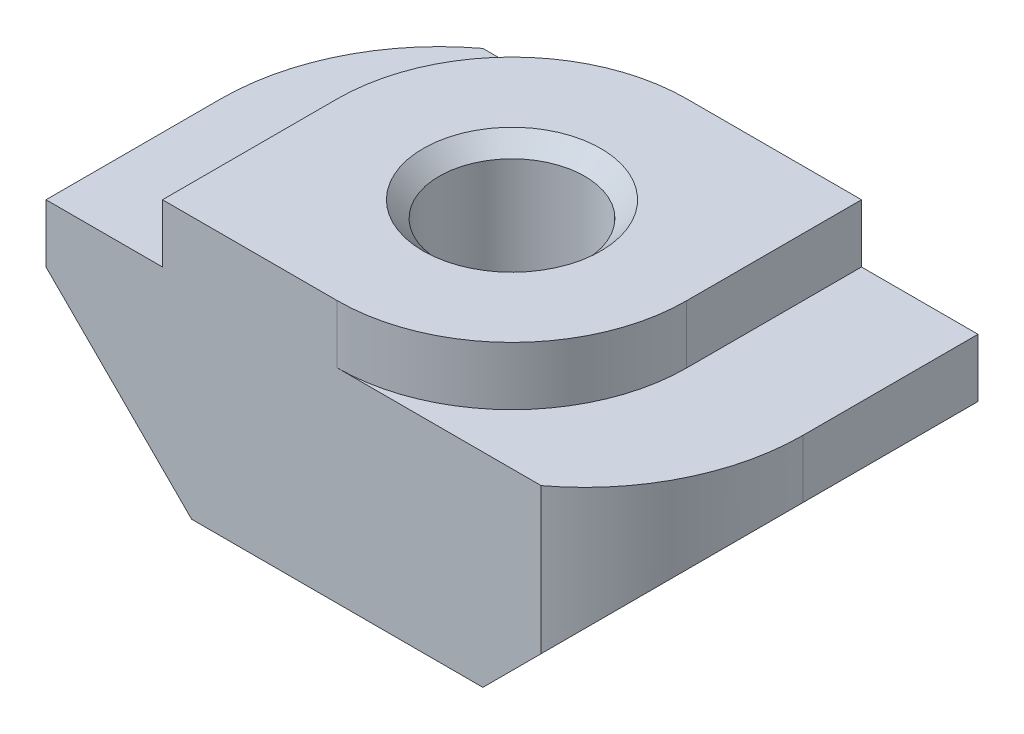
ISO-10303-21;
HEADER;
FILE_DESCRIPTION(('STEP AP214'),'2;1');
FILE_NAME('part.step','',(''),(''),'','','');
FILE_SCHEMA(('AUTOMOTIVE_DESIGN { 1 0 10303 214 1 1 1 1 }'));
ENDSEC;
DATA;
#1=APPLICATION_CONTEXT('core data for automotive mechanical design processes');
#2=APPLICATION_PROTOCOL_DEFINITION('international standard','automotive_design',2000,#1);
#3=PRODUCT_CONTEXT('',#1,'mechanical');
#4=PRODUCT('Part','Part','',(#3));
#5=PRODUCT_RELATED_PRODUCT_CATEGORY('part','',(#4));
#6=PRODUCT_DEFINITION_FORMATION('','',#4);
#7=PRODUCT_DEFINITION_CONTEXT('part definition',#1,'design');
#8=PRODUCT_DEFINITION('design','',#6,#7);
#9=PRODUCT_DEFINITION_SHAPE('','',#8);
#10=(LENGTH_UNIT() NAMED_UNIT(*) SI_UNIT(.MILLI.,.METRE.));
#11=(NAMED_UNIT(*) PLANE_ANGLE_UNIT() SI_UNIT($,.RADIAN.));
#12=(NAMED_UNIT(*) SI_UNIT($,.STERADIAN.) SOLID_ANGLE_UNIT());
#13=UNCERTAINTY_MEASURE_WITH_UNIT(LENGTH_MEASURE(1.E-05),#10,'distance_accuracy_value','');
#14=(GEOMETRIC_REPRESENTATION_CONTEXT(3) GLOBAL_UNCERTAINTY_ASSIGNED_CONTEXT((#13)) GLOBAL_UNIT_ASSIGNED_CONTEXT((#10,
#11,#12)) REPRESENTATION_CONTEXT('',''));
#15=CARTESIAN_POINT('',(0.,0.,0.));
#16=DIRECTION('',(0.,0.,1.));
#17=DIRECTION('',(1.,0.,0.));
#18=AXIS2_PLACEMENT_3D('',#15,#16,#17);
#19=CARTESIAN_POINT('',(0.,4.5,3.));
#20=DIRECTION('',(0.,1.,0.));
#21=DIRECTION('',(0.,0.,1.));
#22=AXIS2_PLACEMENT_3D('',#19,#20,#21);
#23=CYLINDRICAL_SURFACE('',#22,1.25);
#24=CARTESIAN_POINT('',(0.,0.,3.));
#25=DIRECTION('',(0.,1.,0.));
#26=DIRECTION('',(0.,0.,1.));
#27=AXIS2_PLACEMENT_3D('',#24,#25,#26);
#28=CIRCLE('',#27,1.25);
#29=CARTESIAN_POINT('',(0.,0.,4.25));
#30=VERTEX_POINT('',#29);
#31=EDGE_CURVE('E18',#30,#30,#28,.F.);
#32=ORIENTED_EDGE('',*,*,#31,.T.);
#33=EDGE_LOOP('',(#32));
#34=FACE_BOUND('',#33,.T.);
#35=CARTESIAN_POINT('',(0.,4.22500000001946,3.));
#36=DIRECTION('',(0.,1.,0.));
#37=DIRECTION('',(0.,0.,1.));
#38=AXIS2_PLACEMENT_3D('',#35,#36,#37);
#39=CIRCLE('',#38,1.25000000001319);
#40=CARTESIAN_POINT('',(0.,4.22500000001946,4.25000000001319));
#41=VERTEX_POINT('',#40);
#42=EDGE_CURVE('E164',#41,#41,#39,.T.);
#43=ORIENTED_EDGE('',*,*,#42,.T.);
#44=EDGE_LOOP('',(#43));
#45=FACE_BOUND('',#44,.T.);
#46=ADVANCED_FACE('F15',(#34,#45),#23,.F.);
#47=CARTESIAN_POINT('',(-5.,3.5,6.));
#48=DIRECTION('',(1.,0.,0.));
#49=DIRECTION('',(0.,0.,-1.));
#50=AXIS2_PLACEMENT_3D('',#47,#48,#49);
#51=PLANE('',#50);
#52=DIRECTION('',(0.,1.,0.));
#53=VECTOR('',#52,1.);
#54=CARTESIAN_POINT('',(-5.,0.,2.99999999999996));
#55=LINE('',#54,#53);
#56=CARTESIAN_POINT('',(-5.,2.5,2.99999999999998));
#57=VERTEX_POINT('',#56);
#58=CARTESIAN_POINT('',(-5.,3.5,2.99999999999998));
#59=VERTEX_POINT('',#58);
#60=EDGE_CURVE('E167',#57,#59,#55,.T.);
#61=ORIENTED_EDGE('',*,*,#60,.F.);
#62=DIRECTION('',(0.,0.,1.));
#63=VECTOR('',#62,1.);
#64=CARTESIAN_POINT('',(-4.99999999999999,2.49999999999999,6.));
#65=LINE('',#64,#63);
#66=CARTESIAN_POINT('',(-5.,2.5,6.));
#67=VERTEX_POINT('',#66);
#68=EDGE_CURVE('E194',#57,#67,#65,.T.);
#69=ORIENTED_EDGE('',*,*,#68,.T.);
#70=DIRECTION('',(0.,1.,0.));
#71=VECTOR('',#70,1.);
#72=CARTESIAN_POINT('',(-5.,3.5,6.));
#73=LINE('',#72,#71);
#74=CARTESIAN_POINT('',(-5.,3.5,6.));
#75=VERTEX_POINT('',#74);
#76=EDGE_CURVE('E122',#75,#67,#73,.F.);
#77=ORIENTED_EDGE('',*,*,#76,.F.);
#78=DIRECTION('',(0.,0.,-1.));
#79=VECTOR('',#78,1.);
#80=CARTESIAN_POINT('',(-5.,3.5,6.));
#81=LINE('',#80,#79);
#82=EDGE_CURVE('E190',#75,#59,#81,.T.);
#83=ORIENTED_EDGE('',*,*,#82,.T.);
#84=EDGE_LOOP('',(#61,#69,#77,#83));
#85=FACE_BOUND('',#84,.T.);
#86=ADVANCED_FACE('F291',(#85),#51,.F.);
#87=CARTESIAN_POINT('',(-1.25,0.,2.99999999999999));
#88=DIRECTION('',(0.,1.,0.));
#89=DIRECTION('',(0.,0.,1.));
#90=AXIS2_PLACEMENT_3D('',#87,#88,#89);
#91=CYLINDRICAL_SURFACE('',#90,3.75);
#92=DIRECTION('',(0.,1.,0.));
#93=VECTOR('',#92,1.);
#94=CARTESIAN_POINT('',(-3.49999999999998,0.,0.));
#95=LINE('',#94,#93);
#96=CARTESIAN_POINT('',(-3.49999999999999,0.999999999999988,0.));
#97=VERTEX_POINT('',#96);
#98=CARTESIAN_POINT('',(-3.5,3.5,0.));
#99=VERTEX_POINT('',#98);
#100=EDGE_CURVE('E87',#97,#99,#95,.T.);
#101=ORIENTED_EDGE('',*,*,#100,.F.);
#102=CARTESIAN_POINT('',(-1.25,-1.25000000000002,2.99999999999999));
#103=DIRECTION('',(0.707106781186549,0.707106781186546,0.));
#104=DIRECTION('',(-0.707106781186546,0.707106781186549,0.));
#105=AXIS2_PLACEMENT_3D('',#102,#103,#104);
#106=ELLIPSE('',#105,5.30330085889912,3.75);
#107=EDGE_CURVE('E195',#97,#57,#106,.T.);
#108=ORIENTED_EDGE('',*,*,#107,.T.);
#109=ORIENTED_EDGE('',*,*,#60,.T.);
#110=CARTESIAN_POINT('',(-1.25,3.5,2.99999999999999));
#111=DIRECTION('',(0.,1.,0.));
#112=DIRECTION('',(0.,0.,1.));
#113=AXIS2_PLACEMENT_3D('',#110,#111,#112);
#114=CIRCLE('',#113,3.75);
#115=EDGE_CURVE('E188',#59,#99,#114,.F.);
#116=ORIENTED_EDGE('',*,*,#115,.T.);
#117=EDGE_LOOP('',(#101,#108,#109,#116));
#118=FACE_BOUND('',#117,.T.);
#119=ADVANCED_FACE('F289',(#118),#91,.T.);
#120=CARTESIAN_POINT('',(0.,4.50000000000728,3.));
#121=DIRECTION('',(0.,1.,0.));
#122=DIRECTION('',(0.,0.,1.));
#123=AXIS2_PLACEMENT_3D('',#120,#121,#122);
#124=CONICAL_SURFACE('',#123,1.525000000001,0.7853981635008);
#125=ORIENTED_EDGE('',*,*,#42,.F.);
#126=EDGE_LOOP('',(#125));
#127=FACE_BOUND('',#126,.T.);
#128=CARTESIAN_POINT('',(0.,4.50000000002137,3.));
#129=DIRECTION('',(0.,1.,0.));
#130=DIRECTION('',(0.,0.,1.));
#131=AXIS2_PLACEMENT_3D('',#128,#129,#130);
#132=CIRCLE('',#131,1.5250000000151);
#133=CARTESIAN_POINT('',(0.,4.50000000002137,4.5250000000151));
#134=VERTEX_POINT('',#133);
#135=EDGE_CURVE('E184',#134,#134,#132,.T.);
#136=ORIENTED_EDGE('',*,*,#135,.T.);
#137=EDGE_LOOP('',(#136));
#138=FACE_BOUND('',#137,.T.);
#139=ADVANCED_FACE('F442',(#127,#138),#124,.F.);
#140=CARTESIAN_POINT('',(-3.,4.5,6.));
#141=DIRECTION('',(1.,0.,0.));
#142=DIRECTION('',(0.,0.,-1.));
#143=AXIS2_PLACEMENT_3D('',#140,#141,#142);
#144=PLANE('',#143);
#145=DIRECTION('',(0.,1.,0.));
#146=VECTOR('',#145,1.);
#147=CARTESIAN_POINT('',(-3.,-0.742640687119286,3.));
#148=LINE('',#147,#146);
#149=CARTESIAN_POINT('',(-3.,3.5,3.));
#150=VERTEX_POINT('',#149);
#151=CARTESIAN_POINT('',(-3.,4.5,3.));
#152=VERTEX_POINT('',#151);
#153=EDGE_CURVE('E231',#150,#152,#148,.T.);
#154=ORIENTED_EDGE('',*,*,#153,.F.);
#155=DIRECTION('',(0.,0.,-1.));
#156=VECTOR('',#155,1.);
#157=CARTESIAN_POINT('',(-3.,3.5,6.));
#158=LINE('',#157,#156);
#159=CARTESIAN_POINT('',(-3.,3.5,6.));
#160=VERTEX_POINT('',#159);
#161=EDGE_CURVE('E193',#150,#160,#158,.F.);
#162=ORIENTED_EDGE('',*,*,#161,.T.);
#163=DIRECTION('',(0.,1.,0.));
#164=VECTOR('',#163,1.);
#165=CARTESIAN_POINT('',(-3.,4.5,6.));
#166=LINE('',#165,#164);
#167=CARTESIAN_POINT('',(-3.,4.5,6.));
#168=VERTEX_POINT('',#167);
#169=EDGE_CURVE('E166',#168,#160,#166,.F.);
#170=ORIENTED_EDGE('',*,*,#169,.F.);
#171=DIRECTION('',(0.,0.,-1.));
#172=VECTOR('',#171,1.);
#173=CARTESIAN_POINT('',(-3.,4.5,6.));
#174=LINE('',#173,#172);
#175=EDGE_CURVE('E183',#168,#152,#174,.T.);
#176=ORIENTED_EDGE('',*,*,#175,.T.);
#177=EDGE_LOOP('',(#154,#162,#170,#176));
#178=FACE_BOUND('',#177,.T.);
#179=ADVANCED_FACE('F277',(#178),#144,.F.);
#180=CARTESIAN_POINT('',(0.,-0.742640687119286,3.00000000000001));
#181=DIRECTION('',(0.,1.,0.));
#182=DIRECTION('',(0.,0.,1.));
#183=AXIS2_PLACEMENT_3D('',#180,#181,#182);
#184=CYLINDRICAL_SURFACE('',#183,3.00000000000001);
#185=DIRECTION('',(0.,1.,0.));
#186=VECTOR('',#185,1.);
#187=CARTESIAN_POINT('',(0.,0.,0.));
#188=LINE('',#187,#186);
#189=CARTESIAN_POINT('',(0.,3.5,0.));
#190=VERTEX_POINT('',#189);
#191=CARTESIAN_POINT('',(0.,4.5,0.));
#192=VERTEX_POINT('',#191);
#193=EDGE_CURVE('E224',#190,#192,#188,.T.);
#194=ORIENTED_EDGE('',*,*,#193,.F.);
#195=CARTESIAN_POINT('',(0.,3.5,3.00000000000001));
#196=DIRECTION('',(0.,1.,0.));
#197=DIRECTION('',(0.,0.,1.));
#198=AXIS2_PLACEMENT_3D('',#195,#196,#197);
#199=CIRCLE('',#198,3.00000000000001);
#200=EDGE_CURVE('E191',#190,#150,#199,.T.);
#201=ORIENTED_EDGE('',*,*,#200,.T.);
#202=ORIENTED_EDGE('',*,*,#153,.T.);
#203=CARTESIAN_POINT('',(0.,4.5,3.00000000000001));
#204=DIRECTION('',(0.,1.,0.));
#205=DIRECTION('',(0.,0.,1.));
#206=AXIS2_PLACEMENT_3D('',#203,#204,#205);
#207=CIRCLE('',#206,3.00000000000001);
#208=EDGE_CURVE('E179',#152,#192,#207,.F.);
#209=ORIENTED_EDGE('',*,*,#208,.T.);
#210=EDGE_LOOP('',(#194,#201,#202,#209));
#211=FACE_BOUND('',#210,.T.);
#212=ADVANCED_FACE('F284',(#211),#184,.T.);
#213=CARTESIAN_POINT('',(0.,-0.742640687119286,3.));
#214=DIRECTION('',(0.,1.,0.));
#215=DIRECTION('',(0.,0.,1.));
#216=AXIS2_PLACEMENT_3D('',#213,#214,#215);
#217=CYLINDRICAL_SURFACE('',#216,3.);
#218=DIRECTION('',(0.,1.,0.));
#219=VECTOR('',#218,1.);
#220=CARTESIAN_POINT('',(0.,-0.742640687119286,6.));
#221=LINE('',#220,#219);
#222=CARTESIAN_POINT('',(0.,4.5,6.));
#223=VERTEX_POINT('',#222);
#224=CARTESIAN_POINT('',(0.,3.5,6.));
#225=VERTEX_POINT('',#224);
#226=EDGE_CURVE('E229',#223,#225,#221,.F.);
#227=ORIENTED_EDGE('',*,*,#226,.T.);
#228=CARTESIAN_POINT('',(0.,3.5,3.));
#229=DIRECTION('',(0.,1.,0.));
#230=DIRECTION('',(0.,0.,1.));
#231=AXIS2_PLACEMENT_3D('',#228,#229,#230);
#232=CIRCLE('',#231,3.);
#233=CARTESIAN_POINT('',(3.,3.5,3.));
#234=VERTEX_POINT('',#233);
#235=EDGE_CURVE('E171',#225,#234,#232,.T.);
#236=ORIENTED_EDGE('',*,*,#235,.T.);
#237=DIRECTION('',(0.,1.,0.));
#238=VECTOR('',#237,1.);
#239=CARTESIAN_POINT('',(3.,4.5,3.));
#240=LINE('',#239,#238);
#241=CARTESIAN_POINT('',(3.,4.5,3.));
#242=VERTEX_POINT('',#241);
#243=EDGE_CURVE('E227',#234,#242,#240,.T.);
#244=ORIENTED_EDGE('',*,*,#243,.T.);
#245=CARTESIAN_POINT('',(0.,4.5,3.));
#246=DIRECTION('',(0.,1.,0.));
#247=DIRECTION('',(0.,0.,1.));
#248=AXIS2_PLACEMENT_3D('',#245,#246,#247);
#249=CIRCLE('',#248,3.);
#250=EDGE_CURVE('E175',#242,#223,#249,.F.);
#251=ORIENTED_EDGE('',*,*,#250,.T.);
#252=EDGE_LOOP('',(#227,#236,#244,#251));
#253=FACE_BOUND('',#252,.T.);
#254=ADVANCED_FACE('F295',(#253),#217,.T.);
#255=CARTESIAN_POINT('',(3.,4.5,6.));
#256=DIRECTION('',(-1.,0.,0.));
#257=DIRECTION('',(0.,0.,1.));
#258=AXIS2_PLACEMENT_3D('',#255,#256,#257);
#259=PLANE('',#258);
#260=ORIENTED_EDGE('',*,*,#243,.F.);
#261=DIRECTION('',(0.,0.,-1.));
#262=VECTOR('',#261,1.);
#263=CARTESIAN_POINT('',(3.,3.5,6.));
#264=LINE('',#263,#262);
#265=CARTESIAN_POINT('',(3.,3.5,0.));
#266=VERTEX_POINT('',#265);
#267=EDGE_CURVE('E174',#234,#266,#264,.T.);
#268=ORIENTED_EDGE('',*,*,#267,.T.);
#269=DIRECTION('',(0.,1.,0.));
#270=VECTOR('',#269,1.);
#271=CARTESIAN_POINT('',(3.,0.,0.));
#272=LINE('',#271,#270);
#273=CARTESIAN_POINT('',(3.,4.5,0.));
#274=VERTEX_POINT('',#273);
#275=EDGE_CURVE('E215',#274,#266,#272,.F.);
#276=ORIENTED_EDGE('',*,*,#275,.F.);
#277=DIRECTION('',(0.,0.,-1.));
#278=VECTOR('',#277,1.);
#279=CARTESIAN_POINT('',(3.,4.5,6.));
#280=LINE('',#279,#278);
#281=EDGE_CURVE('E178',#274,#242,#280,.F.);
#282=ORIENTED_EDGE('',*,*,#281,.T.);
#283=EDGE_LOOP('',(#260,#268,#276,#282));
#284=FACE_BOUND('',#283,.T.);
#285=ADVANCED_FACE('F301',(#284),#259,.F.);
#286=CARTESIAN_POINT('',(0.,0.,0.));
#287=DIRECTION('',(0.,0.,-1.));
#288=DIRECTION('',(-1.,0.,0.));
#289=AXIS2_PLACEMENT_3D('',#286,#287,#288);
#290=PLANE('',#289);
#291=DIRECTION('',(1.,0.,0.));
#292=VECTOR('',#291,1.);
#293=CARTESIAN_POINT('',(2.50000000000001,0.,0.));
#294=LINE('',#293,#292);
#295=CARTESIAN_POINT('',(2.50000000000001,0.,0.));
#296=VERTEX_POINT('',#295);
#297=CARTESIAN_POINT('',(-2.50000000000001,0.,0.));
#298=VERTEX_POINT('',#297);
#299=EDGE_CURVE('E97',#296,#298,#294,.F.);
#300=ORIENTED_EDGE('',*,*,#299,.T.);
#301=DIRECTION('',(-0.707106781186546,0.707106781186549,0.));
#302=VECTOR('',#301,1.);
#303=CARTESIAN_POINT('',(-5.,2.5,0.));
#304=LINE('',#303,#302);
#305=EDGE_CURVE('E132',#298,#97,#304,.T.);
#306=ORIENTED_EDGE('',*,*,#305,.T.);
#307=ORIENTED_EDGE('',*,*,#100,.T.);
#308=DIRECTION('',(1.,0.,0.));
#309=VECTOR('',#308,1.);
#310=CARTESIAN_POINT('',(-3.,3.5,0.));
#311=LINE('',#310,#309);
#312=EDGE_CURVE('E187',#99,#190,#311,.T.);
#313=ORIENTED_EDGE('',*,*,#312,.T.);
#314=ORIENTED_EDGE('',*,*,#193,.T.);
#315=DIRECTION('',(1.,0.,0.));
#316=VECTOR('',#315,1.);
#317=CARTESIAN_POINT('',(-3.,4.5,0.));
#318=LINE('',#317,#316);
#319=EDGE_CURVE('E182',#192,#274,#318,.T.);
#320=ORIENTED_EDGE('',*,*,#319,.T.);
#321=ORIENTED_EDGE('',*,*,#275,.T.);
#322=DIRECTION('',(1.,0.,0.));
#323=VECTOR('',#322,1.);
#324=CARTESIAN_POINT('',(3.,3.5,0.));
#325=LINE('',#324,#323);
#326=CARTESIAN_POINT('',(5.,3.5,0.));
#327=VERTEX_POINT('',#326);
#328=EDGE_CURVE('E218',#266,#327,#325,.T.);
#329=ORIENTED_EDGE('',*,*,#328,.T.);
#330=DIRECTION('',(0.,1.,0.));
#331=VECTOR('',#330,1.);
#332=CARTESIAN_POINT('',(5.,3.5,0.));
#333=LINE('',#332,#331);
#334=CARTESIAN_POINT('',(5.,2.5,0.));
#335=VERTEX_POINT('',#334);
#336=EDGE_CURVE('E212',#327,#335,#333,.F.);
#337=ORIENTED_EDGE('',*,*,#336,.T.);
#338=DIRECTION('',(-0.707106781186546,-0.707106781186549,0.));
#339=VECTOR('',#338,1.);
#340=CARTESIAN_POINT('',(5.,2.5,0.));
#341=LINE('',#340,#339);
#342=EDGE_CURVE('E159',#335,#296,#341,.T.);
#343=ORIENTED_EDGE('',*,*,#342,.T.);
#344=EDGE_LOOP('',(#300,#306,#307,#313,#314,#320,#321,#329,#337,#343));
#345=FACE_BOUND('',#344,.T.);
#346=ADVANCED_FACE('F288',(#345),#290,.T.);
#347=CARTESIAN_POINT('',(5.,3.5,6.));
#348=DIRECTION('',(-1.,0.,0.));
#349=DIRECTION('',(0.,0.,1.));
#350=AXIS2_PLACEMENT_3D('',#347,#348,#349);
#351=PLANE('',#350);
#352=DIRECTION('',(0.,1.,0.));
#353=VECTOR('',#352,1.);
#354=CARTESIAN_POINT('',(5.,3.5,3.));
#355=LINE('',#354,#353);
#356=CARTESIAN_POINT('',(5.,2.5,3.));
#357=VERTEX_POINT('',#356);
#358=CARTESIAN_POINT('',(5.,3.5,3.));
#359=VERTEX_POINT('',#358);
#360=EDGE_CURVE('E161',#357,#359,#355,.T.);
#361=ORIENTED_EDGE('',*,*,#360,.F.);
#362=DIRECTION('',(0.,0.,1.));
#363=VECTOR('',#362,1.);
#364=CARTESIAN_POINT('',(5.,2.5,6.));
#365=LINE('',#364,#363);
#366=EDGE_CURVE('E203',#357,#335,#365,.F.);
#367=ORIENTED_EDGE('',*,*,#366,.T.);
#368=ORIENTED_EDGE('',*,*,#336,.F.);
#369=DIRECTION('',(0.,0.,-1.));
#370=VECTOR('',#369,1.);
#371=CARTESIAN_POINT('',(5.,3.5,6.));
#372=LINE('',#371,#370);
#373=EDGE_CURVE('E170',#327,#359,#372,.F.);
#374=ORIENTED_EDGE('',*,*,#373,.T.);
#375=EDGE_LOOP('',(#361,#367,#368,#374));
#376=FACE_BOUND('',#375,.T.);
#377=ADVANCED_FACE('F323',(#376),#351,.F.);
#378=CARTESIAN_POINT('',(5.,2.5,6.));
#379=DIRECTION('',(-0.707106781186549,0.707106781186546,0.));
#380=DIRECTION('',(-0.707106781186546,-0.707106781186549,0.));
#381=AXIS2_PLACEMENT_3D('',#378,#379,#380);
#382=PLANE('',#381);
#383=CARTESIAN_POINT('',(1.25,-1.25000000000002,3.));
#384=DIRECTION('',(-0.707106781186549,0.707106781186546,0.));
#385=DIRECTION('',(0.707106781186546,0.707106781186549,0.));
#386=AXIS2_PLACEMENT_3D('',#383,#384,#385);
#387=ELLIPSE('',#386,5.30330085889912,3.75);
#388=CARTESIAN_POINT('',(3.5,0.999999999999994,6.));
#389=VERTEX_POINT('',#388);
#390=EDGE_CURVE('E145',#389,#357,#387,.T.);
#391=ORIENTED_EDGE('',*,*,#390,.F.);
#392=DIRECTION('',(-0.707106781186546,-0.707106781186549,0.));
#393=VECTOR('',#392,1.);
#394=CARTESIAN_POINT('',(5.,2.5,6.));
#395=LINE('',#394,#393);
#396=CARTESIAN_POINT('',(2.50000000000001,0.,6.));
#397=VERTEX_POINT('',#396);
#398=EDGE_CURVE('E33',#397,#389,#395,.F.);
#399=ORIENTED_EDGE('',*,*,#398,.F.);
#400=DIRECTION('',(0.,0.,1.));
#401=VECTOR('',#400,1.);
#402=CARTESIAN_POINT('',(2.50000000000001,0.,6.));
#403=LINE('',#402,#401);
#404=EDGE_CURVE('E144',#397,#296,#403,.F.);
#405=ORIENTED_EDGE('',*,*,#404,.T.);
#406=ORIENTED_EDGE('',*,*,#342,.F.);
#407=ORIENTED_EDGE('',*,*,#366,.F.);
#408=EDGE_LOOP('',(#391,#399,#405,#406,#407));
#409=FACE_BOUND('',#408,.T.);
#410=ADVANCED_FACE('F328',(#409),#382,.F.);
#411=CARTESIAN_POINT('',(2.50000000000001,0.,6.));
#412=DIRECTION('',(0.,1.,0.));
#413=DIRECTION('',(0.,0.,1.));
#414=AXIS2_PLACEMENT_3D('',#411,#412,#413);
#415=PLANE('',#414);
#416=ORIENTED_EDGE('',*,*,#404,.F.);
#417=DIRECTION('',(-1.,0.,0.));
#418=VECTOR('',#417,1.);
#419=CARTESIAN_POINT('',(0.,0.,6.));
#420=LINE('',#419,#418);
#421=CARTESIAN_POINT('',(-2.50000000000001,0.,6.));
#422=VERTEX_POINT('',#421);
#423=EDGE_CURVE('E137',#397,#422,#420,.T.);
#424=ORIENTED_EDGE('',*,*,#423,.T.);
#425=DIRECTION('',(0.,0.,1.));
#426=VECTOR('',#425,1.);
#427=CARTESIAN_POINT('',(-2.50000000000001,0.,6.));
#428=LINE('',#427,#426);
#429=EDGE_CURVE('E128',#422,#298,#428,.F.);
#430=ORIENTED_EDGE('',*,*,#429,.T.);
#431=ORIENTED_EDGE('',*,*,#299,.F.);
#432=EDGE_LOOP('',(#416,#424,#430,#431));
#433=FACE_BOUND('',#432,.T.);
#434=ORIENTED_EDGE('',*,*,#31,.F.);
#435=EDGE_LOOP('',(#434));
#436=FACE_BOUND('',#435,.T.);
#437=ADVANCED_FACE('F141',(#433,#436),#415,.F.);
#438=CARTESIAN_POINT('',(-5.,2.5,6.));
#439=DIRECTION('',(0.707106781186549,0.707106781186546,0.));
#440=DIRECTION('',(-0.707106781186546,0.707106781186549,0.));
#441=AXIS2_PLACEMENT_3D('',#438,#439,#440);
#442=PLANE('',#441);
#443=ORIENTED_EDGE('',*,*,#107,.F.);
#444=ORIENTED_EDGE('',*,*,#305,.F.);
#445=ORIENTED_EDGE('',*,*,#429,.F.);
#446=DIRECTION('',(-0.707106781186546,0.707106781186549,0.));
#447=VECTOR('',#446,1.);
#448=CARTESIAN_POINT('',(-2.50000000000001,0.,6.));
#449=LINE('',#448,#447);
#450=EDGE_CURVE('E131',#422,#67,#449,.T.);
#451=ORIENTED_EDGE('',*,*,#450,.T.);
#452=ORIENTED_EDGE('',*,*,#68,.F.);
#453=EDGE_LOOP('',(#443,#444,#445,#451,#452));
#454=FACE_BOUND('',#453,.T.);
#455=ADVANCED_FACE('F129',(#454),#442,.F.);
#456=CARTESIAN_POINT('',(-3.,3.5,6.));
#457=DIRECTION('',(0.,-1.,0.));
#458=DIRECTION('',(0.,0.,-1.));
#459=AXIS2_PLACEMENT_3D('',#456,#457,#458);
#460=PLANE('',#459);
#461=ORIENTED_EDGE('',*,*,#115,.F.);
#462=ORIENTED_EDGE('',*,*,#82,.F.);
#463=DIRECTION('',(-1.,0.,0.));
#464=VECTOR('',#463,1.);
#465=CARTESIAN_POINT('',(0.,3.5,6.));
#466=LINE('',#465,#464);
#467=EDGE_CURVE('E138',#75,#160,#466,.F.);
#468=ORIENTED_EDGE('',*,*,#467,.T.);
#469=ORIENTED_EDGE('',*,*,#161,.F.);
#470=ORIENTED_EDGE('',*,*,#200,.F.);
#471=ORIENTED_EDGE('',*,*,#312,.F.);
#472=EDGE_LOOP('',(#461,#462,#468,#469,#470,#471));
#473=FACE_BOUND('',#472,.T.);
#474=ADVANCED_FACE('F280',(#473),#460,.F.);
#475=CARTESIAN_POINT('',(-3.,4.5,6.));
#476=DIRECTION('',(0.,-1.,0.));
#477=DIRECTION('',(0.,0.,-1.));
#478=AXIS2_PLACEMENT_3D('',#475,#476,#477);
#479=PLANE('',#478);
#480=ORIENTED_EDGE('',*,*,#250,.F.);
#481=ORIENTED_EDGE('',*,*,#281,.F.);
#482=ORIENTED_EDGE('',*,*,#319,.F.);
#483=ORIENTED_EDGE('',*,*,#208,.F.);
#484=ORIENTED_EDGE('',*,*,#175,.F.);
#485=DIRECTION('',(-1.,0.,0.));
#486=VECTOR('',#485,1.);
#487=CARTESIAN_POINT('',(0.,4.5,6.));
#488=LINE('',#487,#486);
#489=EDGE_CURVE('E244',#168,#223,#488,.F.);
#490=ORIENTED_EDGE('',*,*,#489,.T.);
#491=EDGE_LOOP('',(#480,#481,#482,#483,#484,#490));
#492=FACE_BOUND('',#491,.T.);
#493=ORIENTED_EDGE('',*,*,#135,.F.);
#494=EDGE_LOOP('',(#493));
#495=FACE_BOUND('',#494,.T.);
#496=ADVANCED_FACE('F298',(#492,#495),#479,.F.);
#497=CARTESIAN_POINT('',(3.,3.5,6.));
#498=DIRECTION('',(0.,-1.,0.));
#499=DIRECTION('',(0.,0.,-1.));
#500=AXIS2_PLACEMENT_3D('',#497,#498,#499);
#501=PLANE('',#500);
#502=CARTESIAN_POINT('',(1.25,3.5,3.));
#503=DIRECTION('',(0.,1.,0.));
#504=DIRECTION('',(0.,0.,1.));
#505=AXIS2_PLACEMENT_3D('',#502,#503,#504);
#506=CIRCLE('',#505,3.75);
#507=CARTESIAN_POINT('',(3.5,3.5,6.));
#508=VERTEX_POINT('',#507);
#509=EDGE_CURVE('E148',#359,#508,#506,.F.);
#510=ORIENTED_EDGE('',*,*,#509,.F.);
#511=ORIENTED_EDGE('',*,*,#373,.F.);
#512=ORIENTED_EDGE('',*,*,#328,.F.);
#513=ORIENTED_EDGE('',*,*,#267,.F.);
#514=ORIENTED_EDGE('',*,*,#235,.F.);
#515=DIRECTION('',(-1.,0.,0.));
#516=VECTOR('',#515,1.);
#517=CARTESIAN_POINT('',(0.,3.5,6.));
#518=LINE('',#517,#516);
#519=EDGE_CURVE('E24',#225,#508,#518,.F.);
#520=ORIENTED_EDGE('',*,*,#519,.T.);
#521=EDGE_LOOP('',(#510,#511,#512,#513,#514,#520));
#522=FACE_BOUND('',#521,.T.);
#523=ADVANCED_FACE('F317',(#522),#501,.F.);
#524=CARTESIAN_POINT('',(1.25,0.,3.));
#525=DIRECTION('',(0.,1.,0.));
#526=DIRECTION('',(0.,0.,1.));
#527=AXIS2_PLACEMENT_3D('',#524,#525,#526);
#528=CYLINDRICAL_SURFACE('',#527,3.75);
#529=DIRECTION('',(0.,1.,0.));
#530=VECTOR('',#529,1.);
#531=CARTESIAN_POINT('',(3.5,0.,6.));
#532=LINE('',#531,#530);
#533=EDGE_CURVE('E10',#508,#389,#532,.F.);
#534=ORIENTED_EDGE('',*,*,#533,.T.);
#535=ORIENTED_EDGE('',*,*,#390,.T.);
#536=ORIENTED_EDGE('',*,*,#360,.T.);
#537=ORIENTED_EDGE('',*,*,#509,.T.);
#538=EDGE_LOOP('',(#534,#535,#536,#537));
#539=FACE_BOUND('',#538,.T.);
#540=ADVANCED_FACE('F326',(#539),#528,.T.);
#541=CARTESIAN_POINT('',(0.,0.,6.));
#542=DIRECTION('',(0.,0.,-1.));
#543=DIRECTION('',(-1.,0.,0.));
#544=AXIS2_PLACEMENT_3D('',#541,#542,#543);
#545=PLANE('',#544);
#546=ORIENTED_EDGE('',*,*,#533,.F.);
#547=ORIENTED_EDGE('',*,*,#519,.F.);
#548=ORIENTED_EDGE('',*,*,#226,.F.);
#549=ORIENTED_EDGE('',*,*,#489,.F.);
#550=ORIENTED_EDGE('',*,*,#169,.T.);
#551=ORIENTED_EDGE('',*,*,#467,.F.);
#552=ORIENTED_EDGE('',*,*,#76,.T.);
#553=ORIENTED_EDGE('',*,*,#450,.F.);
#554=ORIENTED_EDGE('',*,*,#423,.F.);
#555=ORIENTED_EDGE('',*,*,#398,.T.);
#556=EDGE_LOOP('',(#546,#547,#548,#549,#550,#551,#552,#553,#554,#555));
#557=FACE_BOUND('',#556,.T.);
#558=ADVANCED_FACE('F136',(#557),#545,.F.);
#559=CLOSED_SHELL('',(#46,#86,#119,#139,#179,#212,#254,#285,#346,#377,#410,#437,#455,#474,#496,
#523,#540,#558));
#560=MANIFOLD_SOLID_BREP('B1',#559);
#561=ADVANCED_BREP_SHAPE_REPRESENTATION('',(#18,#560),#14);
#562=SHAPE_DEFINITION_REPRESENTATION(#9,#561);
ENDSEC;
END-ISO-10303-21;
